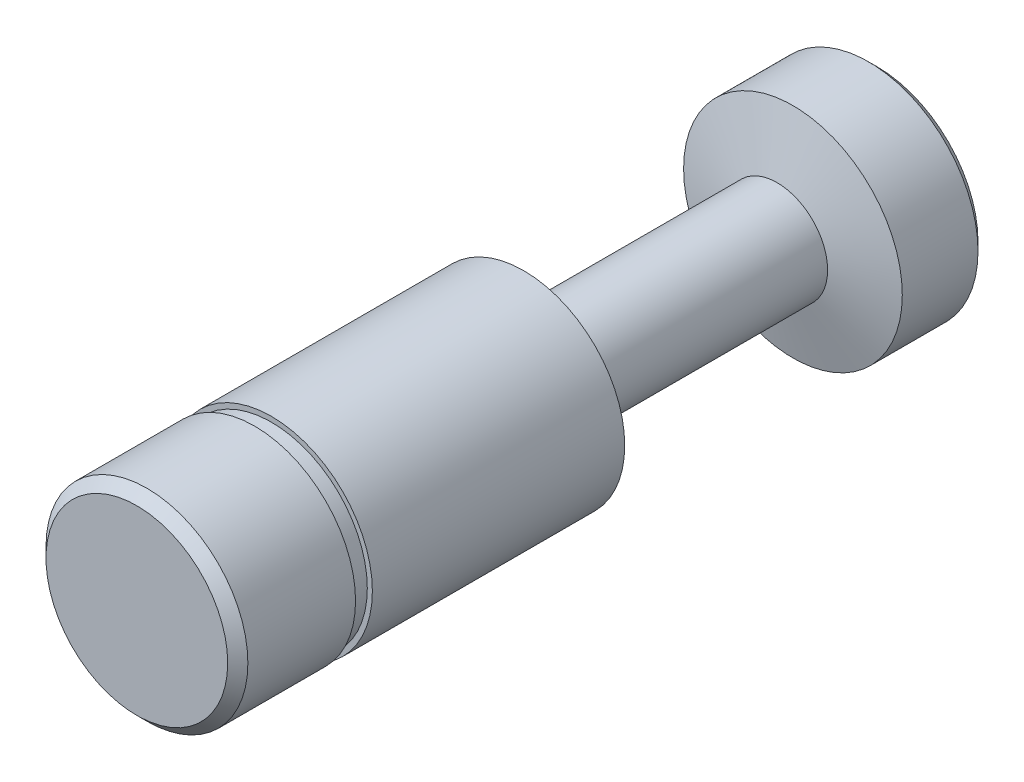
ISO-10303-21;
HEADER;
FILE_DESCRIPTION(('STEP AP214'),'2;1');
FILE_NAME('part.step','',(''),(''),'','','');
FILE_SCHEMA(('AUTOMOTIVE_DESIGN { 1 0 10303 214 1 1 1 1 }'));
ENDSEC;
DATA;
#1=APPLICATION_CONTEXT('core data for automotive mechanical design processes');
#2=APPLICATION_PROTOCOL_DEFINITION('international standard','automotive_design',2000,#1);
#3=PRODUCT_CONTEXT('',#1,'mechanical');
#4=PRODUCT('Part','Part','',(#3));
#5=PRODUCT_RELATED_PRODUCT_CATEGORY('part','',(#4));
#6=PRODUCT_DEFINITION_FORMATION('','',#4);
#7=PRODUCT_DEFINITION_CONTEXT('part definition',#1,'design');
#8=PRODUCT_DEFINITION('design','',#6,#7);
#9=PRODUCT_DEFINITION_SHAPE('','',#8);
#10=(LENGTH_UNIT() NAMED_UNIT(*) SI_UNIT(.MILLI.,.METRE.));
#11=(NAMED_UNIT(*) PLANE_ANGLE_UNIT() SI_UNIT($,.RADIAN.));
#12=(NAMED_UNIT(*) SI_UNIT($,.STERADIAN.) SOLID_ANGLE_UNIT());
#13=UNCERTAINTY_MEASURE_WITH_UNIT(LENGTH_MEASURE(1.E-05),#10,'distance_accuracy_value','');
#14=(GEOMETRIC_REPRESENTATION_CONTEXT(3) GLOBAL_UNCERTAINTY_ASSIGNED_CONTEXT((#13)) GLOBAL_UNIT_ASSIGNED_CONTEXT((#10,
#11,#12)) REPRESENTATION_CONTEXT('',''));
#15=CARTESIAN_POINT('',(0.,0.,0.));
#16=DIRECTION('',(0.,0.,1.));
#17=DIRECTION('',(1.,0.,0.));
#18=AXIS2_PLACEMENT_3D('',#15,#16,#17);
#19=CARTESIAN_POINT('',(0.,0.,-24.73));
#20=DIRECTION('',(0.,0.,1.));
#21=DIRECTION('',(1.,0.,0.));
#22=AXIS2_PLACEMENT_3D('',#19,#20,#21);
#23=CYLINDRICAL_SURFACE('',#22,6.);
#24=CARTESIAN_POINT('',(0.,0.,-23.));
#25=DIRECTION('',(0.,0.,1.));
#26=DIRECTION('',(1.,0.,0.));
#27=AXIS2_PLACEMENT_3D('',#24,#25,#26);
#28=CIRCLE('',#27,6.);
#29=CARTESIAN_POINT('',(6.,0.,-23.));
#30=VERTEX_POINT('',#29);
#31=EDGE_CURVE('E20',#30,#30,#28,.T.);
#32=ORIENTED_EDGE('',*,*,#31,.T.);
#33=EDGE_LOOP('',(#32));
#34=FACE_BOUND('',#33,.T.);
#35=CARTESIAN_POINT('',(0.,0.,-8.));
#36=DIRECTION('',(0.,0.,1.));
#37=DIRECTION('',(1.,0.,0.));
#38=AXIS2_PLACEMENT_3D('',#35,#36,#37);
#39=CIRCLE('',#38,6.);
#40=CARTESIAN_POINT('',(6.,0.,-8.));
#41=VERTEX_POINT('',#40);
#42=EDGE_CURVE('E40',#41,#41,#39,.F.);
#43=ORIENTED_EDGE('',*,*,#42,.T.);
#44=EDGE_LOOP('',(#43));
#45=FACE_BOUND('',#44,.T.);
#46=ADVANCED_FACE('F13',(#34,#45),#23,.T.);
#47=CARTESIAN_POINT('',(0.,0.,-44.));
#48=DIRECTION('',(0.,0.,1.));
#49=DIRECTION('',(1.,0.,0.));
#50=AXIS2_PLACEMENT_3D('',#47,#48,#49);
#51=CYLINDRICAL_SURFACE('',#50,6.5);
#52=CARTESIAN_POINT('',(0.,0.,-39.));
#53=DIRECTION('',(0.,0.,1.));
#54=DIRECTION('',(1.,0.,0.));
#55=AXIS2_PLACEMENT_3D('',#52,#53,#54);
#56=CIRCLE('',#55,6.5);
#57=CARTESIAN_POINT('',(6.5,0.,-39.));
#58=VERTEX_POINT('',#57);
#59=EDGE_CURVE('E9',#58,#58,#56,.F.);
#60=ORIENTED_EDGE('',*,*,#59,.T.);
#61=EDGE_LOOP('',(#60));
#62=FACE_BOUND('',#61,.T.);
#63=CARTESIAN_POINT('',(0.,0.,-43.5));
#64=DIRECTION('',(0.,0.,1.));
#65=DIRECTION('',(1.,0.,0.));
#66=AXIS2_PLACEMENT_3D('',#63,#64,#65);
#67=CIRCLE('',#66,6.5);
#68=CARTESIAN_POINT('',(6.5,0.,-43.5));
#69=VERTEX_POINT('',#68);
#70=EDGE_CURVE('E28',#69,#69,#67,.T.);
#71=ORIENTED_EDGE('',*,*,#70,.T.);
#72=EDGE_LOOP('',(#71));
#73=FACE_BOUND('',#72,.T.);
#74=ADVANCED_FACE('F80',(#62,#73),#51,.T.);
#75=CARTESIAN_POINT('',(0.,0.,-44.));
#76=DIRECTION('',(0.,0.,1.));
#77=DIRECTION('',(1.,0.,0.));
#78=AXIS2_PLACEMENT_3D('',#75,#76,#77);
#79=PLANE('',#78);
#80=CARTESIAN_POINT('',(0.,0.,-44.));
#81=DIRECTION('',(0.,0.,1.));
#82=DIRECTION('',(1.,0.,0.));
#83=AXIS2_PLACEMENT_3D('',#80,#81,#82);
#84=CIRCLE('',#83,6.);
#85=CARTESIAN_POINT('',(6.,0.,-44.));
#86=VERTEX_POINT('',#85);
#87=EDGE_CURVE('E24',#86,#86,#84,.F.);
#88=ORIENTED_EDGE('',*,*,#87,.T.);
#89=EDGE_LOOP('',(#88));
#90=FACE_BOUND('',#89,.T.);
#91=ADVANCED_FACE('F74',(#90),#79,.F.);
#92=CARTESIAN_POINT('',(0.,0.,-38.06));
#93=DIRECTION('',(0.,0.,1.));
#94=DIRECTION('',(1.,0.,0.));
#95=AXIS2_PLACEMENT_3D('',#92,#93,#94);
#96=CYLINDRICAL_SURFACE('',#95,3.);
#97=CARTESIAN_POINT('',(0.,0.,-38.06));
#98=DIRECTION('',(0.,0.,1.));
#99=DIRECTION('',(1.,0.,0.));
#100=AXIS2_PLACEMENT_3D('',#97,#98,#99);
#101=CIRCLE('',#100,3.);
#102=CARTESIAN_POINT('',(3.,0.,-38.06));
#103=VERTEX_POINT('',#102);
#104=EDGE_CURVE('E39',#103,#103,#101,.T.);
#105=ORIENTED_EDGE('',*,*,#104,.T.);
#106=EDGE_LOOP('',(#105));
#107=FACE_BOUND('',#106,.T.);
#108=CARTESIAN_POINT('',(0.,0.,-24.73));
#109=DIRECTION('',(0.,0.,1.));
#110=DIRECTION('',(1.,0.,0.));
#111=AXIS2_PLACEMENT_3D('',#108,#109,#110);
#112=CIRCLE('',#111,3.);
#113=CARTESIAN_POINT('',(3.,0.,-24.73));
#114=VERTEX_POINT('',#113);
#115=EDGE_CURVE('E43',#114,#114,#112,.T.);
#116=ORIENTED_EDGE('',*,*,#115,.F.);
#117=EDGE_LOOP('',(#116));
#118=FACE_BOUND('',#117,.T.);
#119=ADVANCED_FACE('F64',(#107,#118),#96,.T.);
#120=CARTESIAN_POINT('',(0.,0.,-8.));
#121=DIRECTION('',(0.,0.,1.));
#122=DIRECTION('',(1.,0.,0.));
#123=AXIS2_PLACEMENT_3D('',#120,#121,#122);
#124=PLANE('',#123);
#125=ORIENTED_EDGE('',*,*,#42,.F.);
#126=EDGE_LOOP('',(#125));
#127=FACE_BOUND('',#126,.T.);
#128=CARTESIAN_POINT('',(0.,0.,-8.));
#129=DIRECTION('',(0.,0.,1.));
#130=DIRECTION('',(1.,0.,0.));
#131=AXIS2_PLACEMENT_3D('',#128,#129,#130);
#132=CIRCLE('',#131,5.7);
#133=CARTESIAN_POINT('',(5.7,0.,-8.));
#134=VERTEX_POINT('',#133);
#135=EDGE_CURVE('E47',#134,#134,#132,.T.);
#136=ORIENTED_EDGE('',*,*,#135,.F.);
#137=EDGE_LOOP('',(#136));
#138=FACE_BOUND('',#137,.T.);
#139=ADVANCED_FACE('F61',(#127,#138),#124,.T.);
#140=CARTESIAN_POINT('',(0.,0.,-7.));
#141=DIRECTION('',(0.,0.,1.));
#142=DIRECTION('',(1.,0.,0.));
#143=AXIS2_PLACEMENT_3D('',#140,#141,#142);
#144=PLANE('',#143);
#145=CARTESIAN_POINT('',(0.,0.,-7.));
#146=DIRECTION('',(0.,0.,1.));
#147=DIRECTION('',(1.,0.,0.));
#148=AXIS2_PLACEMENT_3D('',#145,#146,#147);
#149=CIRCLE('',#148,6.);
#150=CARTESIAN_POINT('',(6.,0.,-7.));
#151=VERTEX_POINT('',#150);
#152=EDGE_CURVE('E44',#151,#151,#149,.F.);
#153=ORIENTED_EDGE('',*,*,#152,.T.);
#154=EDGE_LOOP('',(#153));
#155=FACE_BOUND('',#154,.T.);
#156=CARTESIAN_POINT('',(0.,0.,-7.));
#157=DIRECTION('',(0.,0.,1.));
#158=DIRECTION('',(1.,0.,0.));
#159=AXIS2_PLACEMENT_3D('',#156,#157,#158);
#160=CIRCLE('',#159,5.7);
#161=CARTESIAN_POINT('',(5.7,0.,-7.));
#162=VERTEX_POINT('',#161);
#163=EDGE_CURVE('E52',#162,#162,#160,.T.);
#164=ORIENTED_EDGE('',*,*,#163,.T.);
#165=EDGE_LOOP('',(#164));
#166=FACE_BOUND('',#165,.T.);
#167=ADVANCED_FACE('F63',(#155,#166),#144,.F.);
#168=CARTESIAN_POINT('',(0.,0.,-8.));
#169=DIRECTION('',(0.,0.,1.));
#170=DIRECTION('',(1.,0.,0.));
#171=AXIS2_PLACEMENT_3D('',#168,#169,#170);
#172=CYLINDRICAL_SURFACE('',#171,5.7);
#173=ORIENTED_EDGE('',*,*,#135,.T.);
#174=EDGE_LOOP('',(#173));
#175=FACE_BOUND('',#174,.T.);
#176=ORIENTED_EDGE('',*,*,#163,.F.);
#177=EDGE_LOOP('',(#176));
#178=FACE_BOUND('',#177,.T.);
#179=ADVANCED_FACE('F58',(#175,#178),#172,.T.);
#180=CARTESIAN_POINT('',(0.,0.,0.));
#181=DIRECTION('',(0.,0.,1.));
#182=DIRECTION('',(1.,0.,0.));
#183=AXIS2_PLACEMENT_3D('',#180,#181,#182);
#184=PLANE('',#183);
#185=CARTESIAN_POINT('',(0.,0.,0.));
#186=DIRECTION('',(0.,0.,1.));
#187=DIRECTION('',(1.,0.,0.));
#188=AXIS2_PLACEMENT_3D('',#185,#186,#187);
#189=CIRCLE('',#188,5.39999999999999);
#190=CARTESIAN_POINT('',(5.39999999999999,0.,0.));
#191=VERTEX_POINT('',#190);
#192=EDGE_CURVE('E36',#191,#191,#189,.T.);
#193=ORIENTED_EDGE('',*,*,#192,.T.);
#194=EDGE_LOOP('',(#193));
#195=FACE_BOUND('',#194,.T.);
#196=ADVANCED_FACE('F91',(#195),#184,.T.);
#197=CARTESIAN_POINT('',(0.,0.,-0.600000000000007));
#198=DIRECTION('',(0.,0.,1.));
#199=DIRECTION('',(1.,0.,0.));
#200=AXIS2_PLACEMENT_3D('',#197,#198,#199);
#201=CIRCLE('',#200,6.);
#202=CARTESIAN_POINT('',(6.,0.,-0.600000000000007));
#203=VERTEX_POINT('',#202);
#204=EDGE_CURVE('E33',#203,#203,#201,.F.);
#205=ORIENTED_EDGE('',*,*,#204,.T.);
#206=EDGE_LOOP('',(#205));
#207=FACE_BOUND('',#206,.T.);
#208=ORIENTED_EDGE('',*,*,#152,.F.);
#209=EDGE_LOOP('',(#208));
#210=FACE_BOUND('',#209,.T.);
#211=ADVANCED_FACE('F82',(#207,#210),#23,.T.);
#212=CARTESIAN_POINT('',(0.,0.,0.));
#213=DIRECTION('',(0.,0.,-1.));
#214=DIRECTION('',(-1.,0.,0.));
#215=AXIS2_PLACEMENT_3D('',#212,#213,#214);
#216=CONICAL_SURFACE('',#215,5.39999999999999,0.785398163397453);
#217=ORIENTED_EDGE('',*,*,#204,.F.);
#218=EDGE_LOOP('',(#217));
#219=FACE_BOUND('',#218,.T.);
#220=ORIENTED_EDGE('',*,*,#192,.F.);
#221=EDGE_LOOP('',(#220));
#222=FACE_BOUND('',#221,.T.);
#223=ADVANCED_FACE('F90',(#219,#222),#216,.T.);
#224=CARTESIAN_POINT('',(0.,0.,-43.5));
#225=DIRECTION('',(0.,0.,1.));
#226=DIRECTION('',(1.,0.,0.));
#227=AXIS2_PLACEMENT_3D('',#224,#225,#226);
#228=CONICAL_SURFACE('',#227,6.5,0.785398163397449);
#229=ORIENTED_EDGE('',*,*,#87,.F.);
#230=EDGE_LOOP('',(#229));
#231=FACE_BOUND('',#230,.T.);
#232=ORIENTED_EDGE('',*,*,#70,.F.);
#233=EDGE_LOOP('',(#232));
#234=FACE_BOUND('',#233,.T.);
#235=ADVANCED_FACE('F97',(#231,#234),#228,.T.);
#236=CARTESIAN_POINT('',(0.,0.,-24.73));
#237=DIRECTION('',(0.,0.,1.));
#238=DIRECTION('',(1.,0.,0.));
#239=AXIS2_PLACEMENT_3D('',#236,#237,#238);
#240=CONICAL_SURFACE('',#239,2.99999999999999,1.04771040485295);
#241=ORIENTED_EDGE('',*,*,#31,.F.);
#242=EDGE_LOOP('',(#241));
#243=FACE_BOUND('',#242,.T.);
#244=ORIENTED_EDGE('',*,*,#115,.T.);
#245=EDGE_LOOP('',(#244));
#246=FACE_BOUND('',#245,.T.);
#247=ADVANCED_FACE('F143',(#243,#246),#240,.T.);
#248=CARTESIAN_POINT('',(0.,0.,-38.06));
#249=DIRECTION('',(0.,0.,-1.));
#250=DIRECTION('',(-1.,0.,0.));
#251=AXIS2_PLACEMENT_3D('',#248,#249,#250);
#252=CONICAL_SURFACE('',#251,2.99999999999995,1.30841647513487);
#253=ORIENTED_EDGE('',*,*,#59,.F.);
#254=EDGE_LOOP('',(#253));
#255=FACE_BOUND('',#254,.T.);
#256=ORIENTED_EDGE('',*,*,#104,.F.);
#257=EDGE_LOOP('',(#256));
#258=FACE_BOUND('',#257,.T.);
#259=ADVANCED_FACE('F15',(#255,#258),#252,.T.);
#260=CLOSED_SHELL('',(#46,#74,#91,#119,#139,#167,#179,#196,#211,#223,#235,#247,#259));
#261=MANIFOLD_SOLID_BREP('B1',#260);
#262=ADVANCED_BREP_SHAPE_REPRESENTATION('',(#18,#261),#14);
#263=SHAPE_DEFINITION_REPRESENTATION(#9,#262);
ENDSEC;
END-ISO-10303-21;
